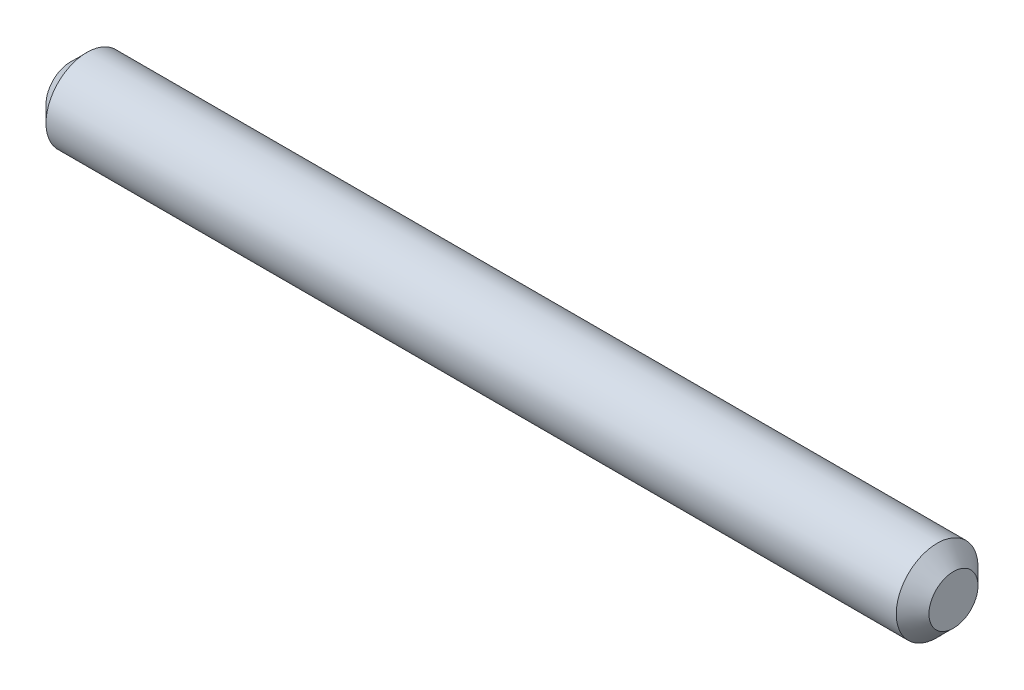
ISO-10303-21;
HEADER;
FILE_DESCRIPTION(('STEP AP214'),'2;1');
FILE_NAME('part.step','',(''),(''),'','','');
FILE_SCHEMA(('AUTOMOTIVE_DESIGN { 1 0 10303 214 1 1 1 1 }'));
ENDSEC;
DATA;
#1=APPLICATION_CONTEXT('core data for automotive mechanical design processes');
#2=APPLICATION_PROTOCOL_DEFINITION('international standard','automotive_design',2000,#1);
#3=PRODUCT_CONTEXT('',#1,'mechanical');
#4=PRODUCT('Part','Part','',(#3));
#5=PRODUCT_RELATED_PRODUCT_CATEGORY('part','',(#4));
#6=PRODUCT_DEFINITION_FORMATION('','',#4);
#7=PRODUCT_DEFINITION_CONTEXT('part definition',#1,'design');
#8=PRODUCT_DEFINITION('design','',#6,#7);
#9=PRODUCT_DEFINITION_SHAPE('','',#8);
#10=(LENGTH_UNIT() NAMED_UNIT(*) SI_UNIT(.MILLI.,.METRE.));
#11=(NAMED_UNIT(*) PLANE_ANGLE_UNIT() SI_UNIT($,.RADIAN.));
#12=(NAMED_UNIT(*) SI_UNIT($,.STERADIAN.) SOLID_ANGLE_UNIT());
#13=UNCERTAINTY_MEASURE_WITH_UNIT(LENGTH_MEASURE(1.E-05),#10,'distance_accuracy_value','');
#14=(GEOMETRIC_REPRESENTATION_CONTEXT(3) GLOBAL_UNCERTAINTY_ASSIGNED_CONTEXT((#13)) GLOBAL_UNIT_ASSIGNED_CONTEXT((#10,
#11,#12)) REPRESENTATION_CONTEXT('',''));
#15=CARTESIAN_POINT('',(0.,0.,0.));
#16=DIRECTION('',(0.,0.,1.));
#17=DIRECTION('',(1.,0.,0.));
#18=AXIS2_PLACEMENT_3D('',#15,#16,#17);
#19=CARTESIAN_POINT('',(-29.9168975069252,0.,0.));
#20=DIRECTION('',(1.,0.,0.));
#21=DIRECTION('',(0.,0.,-1.));
#22=AXIS2_PLACEMENT_3D('',#19,#20,#21);
#23=PLANE('',#22);
#24=CARTESIAN_POINT('',(-29.9168975069252,0.,0.));
#25=DIRECTION('',(1.,0.,0.));
#26=DIRECTION('',(0.,0.,-1.));
#27=AXIS2_PLACEMENT_3D('',#24,#25,#26);
#28=CIRCLE('',#27,1.50000000000001);
#29=CARTESIAN_POINT('',(-29.9168975069252,0.,-1.50000000000001));
#30=VERTEX_POINT('',#29);
#31=EDGE_CURVE('E58',#30,#30,#28,.F.);
#32=ORIENTED_EDGE('',*,*,#31,.T.);
#33=EDGE_LOOP('',(#32));
#34=FACE_BOUND('',#33,.T.);
#35=ADVANCED_FACE('F39',(#34),#23,.F.);
#36=CARTESIAN_POINT('',(-29.9168975069252,0.,0.));
#37=DIRECTION('',(-1.,0.,0.));
#38=DIRECTION('',(0.,0.,1.));
#39=AXIS2_PLACEMENT_3D('',#36,#37,#38);
#40=CYLINDRICAL_SURFACE('',#39,2.5);
#41=CARTESIAN_POINT('',(-28.9168975069252,0.,0.));
#42=DIRECTION('',(1.,0.,0.));
#43=DIRECTION('',(0.,0.,-1.));
#44=AXIS2_PLACEMENT_3D('',#41,#42,#43);
#45=CIRCLE('',#44,2.5);
#46=CARTESIAN_POINT('',(-28.9168975069252,0.,-2.5));
#47=VERTEX_POINT('',#46);
#48=EDGE_CURVE('E48',#47,#47,#45,.T.);
#49=ORIENTED_EDGE('',*,*,#48,.T.);
#50=EDGE_LOOP('',(#49));
#51=FACE_BOUND('',#50,.T.);
#52=CARTESIAN_POINT('',(23.0831024930748,0.,0.));
#53=DIRECTION('',(-1.,0.,0.));
#54=DIRECTION('',(0.,0.,1.));
#55=AXIS2_PLACEMENT_3D('',#52,#53,#54);
#56=CIRCLE('',#55,2.5);
#57=CARTESIAN_POINT('',(23.0831024930748,0.,2.5));
#58=VERTEX_POINT('',#57);
#59=EDGE_CURVE('E53',#58,#58,#56,.T.);
#60=ORIENTED_EDGE('',*,*,#59,.T.);
#61=EDGE_LOOP('',(#60));
#62=FACE_BOUND('',#61,.T.);
#63=ADVANCED_FACE('F75',(#51,#62),#40,.T.);
#64=CARTESIAN_POINT('',(24.0831024930748,2.5,0.));
#65=DIRECTION('',(-1.,0.,0.));
#66=DIRECTION('',(0.,0.,1.));
#67=AXIS2_PLACEMENT_3D('',#64,#65,#66);
#68=PLANE('',#67);
#69=CARTESIAN_POINT('',(24.0831024930748,0.,0.));
#70=DIRECTION('',(-1.,0.,0.));
#71=DIRECTION('',(0.,0.,1.));
#72=AXIS2_PLACEMENT_3D('',#69,#70,#71);
#73=CIRCLE('',#72,1.5);
#74=CARTESIAN_POINT('',(24.0831024930748,0.,1.5));
#75=VERTEX_POINT('',#74);
#76=EDGE_CURVE('E10',#75,#75,#73,.F.);
#77=ORIENTED_EDGE('',*,*,#76,.T.);
#78=EDGE_LOOP('',(#77));
#79=FACE_BOUND('',#78,.T.);
#80=ADVANCED_FACE('F68',(#79),#68,.F.);
#81=CARTESIAN_POINT('',(-29.9168975069252,0.,0.));
#82=DIRECTION('',(1.,0.,0.));
#83=DIRECTION('',(0.,0.,-1.));
#84=AXIS2_PLACEMENT_3D('',#81,#82,#83);
#85=CONICAL_SURFACE('',#84,1.50000000000001,0.785398163397446);
#86=ORIENTED_EDGE('',*,*,#48,.F.);
#87=EDGE_LOOP('',(#86));
#88=FACE_BOUND('',#87,.T.);
#89=ORIENTED_EDGE('',*,*,#31,.F.);
#90=EDGE_LOOP('',(#89));
#91=FACE_BOUND('',#90,.T.);
#92=ADVANCED_FACE('F66',(#88,#91),#85,.T.);
#93=CARTESIAN_POINT('',(23.0831024930748,0.,0.));
#94=DIRECTION('',(-1.,0.,0.));
#95=DIRECTION('',(0.,0.,1.));
#96=AXIS2_PLACEMENT_3D('',#93,#94,#95);
#97=CONICAL_SURFACE('',#96,2.5,0.785398163397447);
#98=ORIENTED_EDGE('',*,*,#76,.F.);
#99=EDGE_LOOP('',(#98));
#100=FACE_BOUND('',#99,.T.);
#101=ORIENTED_EDGE('',*,*,#59,.F.);
#102=EDGE_LOOP('',(#101));
#103=FACE_BOUND('',#102,.T.);
#104=ADVANCED_FACE('F42',(#100,#103),#97,.T.);
#105=CLOSED_SHELL('',(#35,#63,#80,#92,#104));
#106=MANIFOLD_SOLID_BREP('B2',#105);
#107=ADVANCED_BREP_SHAPE_REPRESENTATION('',(#18,#106),#14);
#108=SHAPE_DEFINITION_REPRESENTATION(#9,#107);
ENDSEC;
END-ISO-10303-21;
